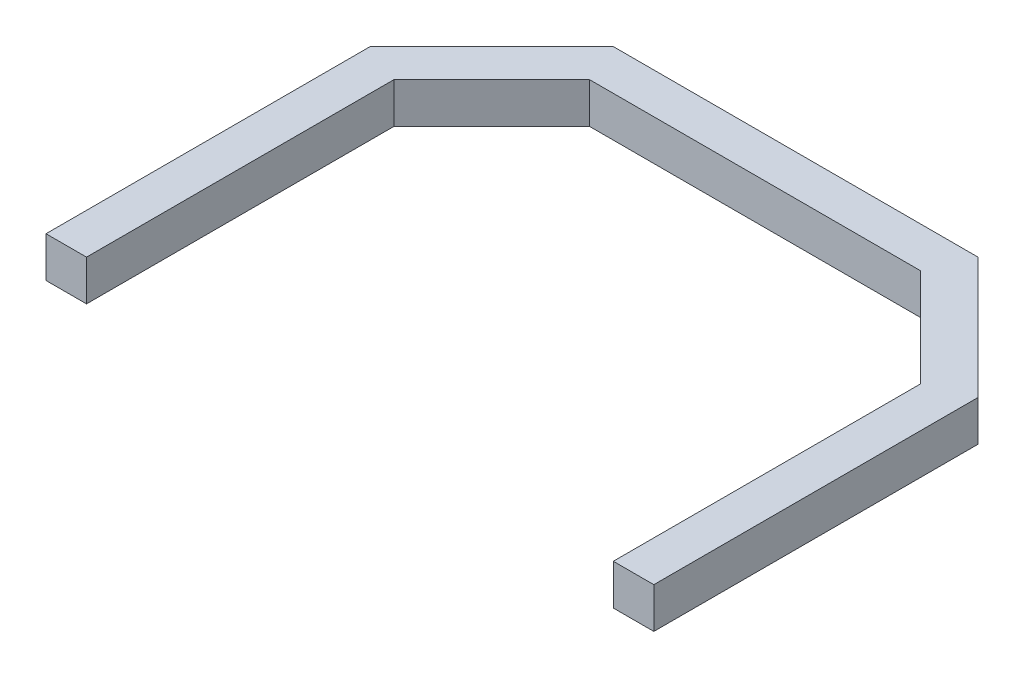
ISO-10303-21;
HEADER;
FILE_DESCRIPTION(('STEP AP214'),'2;1');
FILE_NAME('part.step','',(''),(''),'','','');
FILE_SCHEMA(('AUTOMOTIVE_DESIGN { 1 0 10303 214 1 1 1 1 }'));
ENDSEC;
DATA;
#1=APPLICATION_CONTEXT('core data for automotive mechanical design processes');
#2=APPLICATION_PROTOCOL_DEFINITION('international standard','automotive_design',2000,#1);
#3=PRODUCT_CONTEXT('',#1,'mechanical');
#4=PRODUCT('Part','Part','',(#3));
#5=PRODUCT_RELATED_PRODUCT_CATEGORY('part','',(#4));
#6=PRODUCT_DEFINITION_FORMATION('','',#4);
#7=PRODUCT_DEFINITION_CONTEXT('part definition',#1,'design');
#8=PRODUCT_DEFINITION('design','',#6,#7);
#9=PRODUCT_DEFINITION_SHAPE('','',#8);
#10=(LENGTH_UNIT() NAMED_UNIT(*) SI_UNIT(.MILLI.,.METRE.));
#11=(NAMED_UNIT(*) PLANE_ANGLE_UNIT() SI_UNIT($,.RADIAN.));
#12=(NAMED_UNIT(*) SI_UNIT($,.STERADIAN.) SOLID_ANGLE_UNIT());
#13=UNCERTAINTY_MEASURE_WITH_UNIT(LENGTH_MEASURE(1.E-05),#10,'distance_accuracy_value','');
#14=(GEOMETRIC_REPRESENTATION_CONTEXT(3) GLOBAL_UNCERTAINTY_ASSIGNED_CONTEXT((#13)) GLOBAL_UNIT_ASSIGNED_CONTEXT((#10,
#11,#12)) REPRESENTATION_CONTEXT('',''));
#15=CARTESIAN_POINT('',(0.,0.,0.));
#16=DIRECTION('',(0.,0.,1.));
#17=DIRECTION('',(1.,0.,0.));
#18=AXIS2_PLACEMENT_3D('',#15,#16,#17);
#19=CARTESIAN_POINT('',(35.9847494553377,5.,46.0566448801743));
#20=DIRECTION('',(0.,0.,-1.));
#21=DIRECTION('',(-1.,0.,0.));
#22=AXIS2_PLACEMENT_3D('',#19,#20,#21);
#23=PLANE('',#22);
#24=DIRECTION('',(1.,0.,0.));
#25=VECTOR('',#24,1.);
#26=CARTESIAN_POINT('',(35.9847494553377,0.,46.0566448801743));
#27=LINE('',#26,#25);
#28=CARTESIAN_POINT('',(30.9847494553377,0.,46.0566448801743));
#29=VERTEX_POINT('',#28);
#30=CARTESIAN_POINT('',(35.9847494553377,0.,46.0566448801743));
#31=VERTEX_POINT('',#30);
#32=EDGE_CURVE('E153',#29,#31,#27,.T.);
#33=ORIENTED_EDGE('',*,*,#32,.T.);
#34=DIRECTION('',(0.,-1.,0.));
#35=VECTOR('',#34,1.);
#36=CARTESIAN_POINT('',(35.9847494553377,5.,46.0566448801743));
#37=LINE('',#36,#35);
#38=CARTESIAN_POINT('',(35.9847494553377,5.,46.0566448801743));
#39=VERTEX_POINT('',#38);
#40=EDGE_CURVE('E11',#39,#31,#37,.T.);
#41=ORIENTED_EDGE('',*,*,#40,.F.);
#42=DIRECTION('',(1.,0.,0.));
#43=VECTOR('',#42,1.);
#44=CARTESIAN_POINT('',(35.9847494553377,5.,46.0566448801743));
#45=LINE('',#44,#43);
#46=CARTESIAN_POINT('',(30.9847494553377,5.,46.0566448801743));
#47=VERTEX_POINT('',#46);
#48=EDGE_CURVE('E175',#47,#39,#45,.T.);
#49=ORIENTED_EDGE('',*,*,#48,.F.);
#50=DIRECTION('',(0.,-1.,0.));
#51=VECTOR('',#50,1.);
#52=CARTESIAN_POINT('',(30.9847494553377,5.,46.0566448801743));
#53=LINE('',#52,#51);
#54=EDGE_CURVE('E149',#47,#29,#53,.T.);
#55=ORIENTED_EDGE('',*,*,#54,.T.);
#56=EDGE_LOOP('',(#33,#41,#49,#55));
#57=FACE_BOUND('',#56,.T.);
#58=ADVANCED_FACE('F33',(#57),#23,.F.);
#59=CARTESIAN_POINT('',(35.9847494553377,5.,6.0566448801743));
#60=DIRECTION('',(-1.,0.,0.));
#61=DIRECTION('',(0.,0.,1.));
#62=AXIS2_PLACEMENT_3D('',#59,#60,#61);
#63=PLANE('',#62);
#64=DIRECTION('',(0.,0.,-1.));
#65=VECTOR('',#64,1.);
#66=CARTESIAN_POINT('',(35.9847494553377,0.,6.0566448801743));
#67=LINE('',#66,#65);
#68=CARTESIAN_POINT('',(35.9847494553377,0.,6.0566448801743));
#69=VERTEX_POINT('',#68);
#70=EDGE_CURVE('E156',#31,#69,#67,.T.);
#71=ORIENTED_EDGE('',*,*,#70,.T.);
#72=DIRECTION('',(0.,-1.,0.));
#73=VECTOR('',#72,1.);
#74=CARTESIAN_POINT('',(35.9847494553377,5.,6.0566448801743));
#75=LINE('',#74,#73);
#76=CARTESIAN_POINT('',(35.9847494553377,5.,6.0566448801743));
#77=VERTEX_POINT('',#76);
#78=EDGE_CURVE('E41',#77,#69,#75,.T.);
#79=ORIENTED_EDGE('',*,*,#78,.F.);
#80=DIRECTION('',(0.,0.,-1.));
#81=VECTOR('',#80,1.);
#82=CARTESIAN_POINT('',(35.9847494553377,5.,6.0566448801743));
#83=LINE('',#82,#81);
#84=EDGE_CURVE('E104',#39,#77,#83,.T.);
#85=ORIENTED_EDGE('',*,*,#84,.F.);
#86=ORIENTED_EDGE('',*,*,#40,.T.);
#87=EDGE_LOOP('',(#71,#79,#85,#86));
#88=FACE_BOUND('',#87,.T.);
#89=ADVANCED_FACE('F253',(#88),#63,.F.);
#90=CARTESIAN_POINT('',(20.9847494553377,5.,-8.9433551198257));
#91=DIRECTION('',(-0.707106781186548,0.,0.707106781186548));
#92=DIRECTION('',(0.707106781186548,0.,0.707106781186548));
#93=AXIS2_PLACEMENT_3D('',#90,#91,#92);
#94=PLANE('',#93);
#95=DIRECTION('',(-0.707106781186547,0.,-0.707106781186547));
#96=VECTOR('',#95,1.);
#97=CARTESIAN_POINT('',(20.9847494553377,0.,-8.9433551198257));
#98=LINE('',#97,#96);
#99=CARTESIAN_POINT('',(20.9847494553377,0.,-8.9433551198257));
#100=VERTEX_POINT('',#99);
#101=EDGE_CURVE('E158',#69,#100,#98,.T.);
#102=ORIENTED_EDGE('',*,*,#101,.T.);
#103=DIRECTION('',(0.,-1.,0.));
#104=VECTOR('',#103,1.);
#105=CARTESIAN_POINT('',(20.9847494553377,5.,-8.9433551198257));
#106=LINE('',#105,#104);
#107=CARTESIAN_POINT('',(20.9847494553377,5.,-8.9433551198257));
#108=VERTEX_POINT('',#107);
#109=EDGE_CURVE('E194',#108,#100,#106,.T.);
#110=ORIENTED_EDGE('',*,*,#109,.F.);
#111=DIRECTION('',(-0.707106781186547,0.,-0.707106781186547));
#112=VECTOR('',#111,1.);
#113=CARTESIAN_POINT('',(20.9847494553377,5.,-8.9433551198257));
#114=LINE('',#113,#112);
#115=EDGE_CURVE('E202',#77,#108,#114,.T.);
#116=ORIENTED_EDGE('',*,*,#115,.F.);
#117=ORIENTED_EDGE('',*,*,#78,.T.);
#118=EDGE_LOOP('',(#102,#110,#116,#117));
#119=FACE_BOUND('',#118,.T.);
#120=ADVANCED_FACE('F200',(#119),#94,.F.);
#121=CARTESIAN_POINT('',(-24.0152505446623,5.,-8.9433551198257));
#122=DIRECTION('',(0.,0.,1.));
#123=DIRECTION('',(1.,0.,0.));
#124=AXIS2_PLACEMENT_3D('',#121,#122,#123);
#125=PLANE('',#124);
#126=DIRECTION('',(-1.,0.,0.));
#127=VECTOR('',#126,1.);
#128=CARTESIAN_POINT('',(-24.0152505446623,0.,-8.9433551198257));
#129=LINE('',#128,#127);
#130=CARTESIAN_POINT('',(-24.0152505446623,0.,-8.9433551198257));
#131=VERTEX_POINT('',#130);
#132=EDGE_CURVE('E160',#100,#131,#129,.T.);
#133=ORIENTED_EDGE('',*,*,#132,.T.);
#134=DIRECTION('',(0.,-1.,0.));
#135=VECTOR('',#134,1.);
#136=CARTESIAN_POINT('',(-24.0152505446623,5.,-8.9433551198257));
#137=LINE('',#136,#135);
#138=CARTESIAN_POINT('',(-24.0152505446623,5.,-8.9433551198257));
#139=VERTEX_POINT('',#138);
#140=EDGE_CURVE('E191',#139,#131,#137,.T.);
#141=ORIENTED_EDGE('',*,*,#140,.F.);
#142=DIRECTION('',(-1.,0.,0.));
#143=VECTOR('',#142,1.);
#144=CARTESIAN_POINT('',(-24.0152505446623,5.,-8.9433551198257));
#145=LINE('',#144,#143);
#146=EDGE_CURVE('E220',#108,#139,#145,.T.);
#147=ORIENTED_EDGE('',*,*,#146,.F.);
#148=ORIENTED_EDGE('',*,*,#109,.T.);
#149=EDGE_LOOP('',(#133,#141,#147,#148));
#150=FACE_BOUND('',#149,.T.);
#151=ADVANCED_FACE('F211',(#150),#125,.F.);
#152=CARTESIAN_POINT('',(-39.0152505446623,5.,6.0566448801743));
#153=DIRECTION('',(0.707106781186548,0.,0.707106781186548));
#154=DIRECTION('',(0.707106781186548,0.,-0.707106781186548));
#155=AXIS2_PLACEMENT_3D('',#152,#153,#154);
#156=PLANE('',#155);
#157=DIRECTION('',(-0.707106781186547,0.,0.707106781186547));
#158=VECTOR('',#157,1.);
#159=CARTESIAN_POINT('',(-39.0152505446623,0.,6.0566448801743));
#160=LINE('',#159,#158);
#161=CARTESIAN_POINT('',(-39.0152505446623,0.,6.0566448801743));
#162=VERTEX_POINT('',#161);
#163=EDGE_CURVE('E162',#131,#162,#160,.T.);
#164=ORIENTED_EDGE('',*,*,#163,.T.);
#165=DIRECTION('',(0.,-1.,0.));
#166=VECTOR('',#165,1.);
#167=CARTESIAN_POINT('',(-39.0152505446623,5.,6.0566448801743));
#168=LINE('',#167,#166);
#169=CARTESIAN_POINT('',(-39.0152505446623,5.,6.0566448801743));
#170=VERTEX_POINT('',#169);
#171=EDGE_CURVE('E188',#170,#162,#168,.T.);
#172=ORIENTED_EDGE('',*,*,#171,.F.);
#173=DIRECTION('',(-0.707106781186547,0.,0.707106781186547));
#174=VECTOR('',#173,1.);
#175=CARTESIAN_POINT('',(-39.0152505446623,5.,6.0566448801743));
#176=LINE('',#175,#174);
#177=EDGE_CURVE('E217',#139,#170,#176,.T.);
#178=ORIENTED_EDGE('',*,*,#177,.F.);
#179=ORIENTED_EDGE('',*,*,#140,.T.);
#180=EDGE_LOOP('',(#164,#172,#178,#179));
#181=FACE_BOUND('',#180,.T.);
#182=ADVANCED_FACE('F215',(#181),#156,.F.);
#183=CARTESIAN_POINT('',(-39.0152505446623,5.,6.0566448801743));
#184=DIRECTION('',(1.,0.,0.));
#185=DIRECTION('',(0.,0.,-1.));
#186=AXIS2_PLACEMENT_3D('',#183,#184,#185);
#187=PLANE('',#186);
#188=DIRECTION('',(0.,0.,1.));
#189=VECTOR('',#188,1.);
#190=CARTESIAN_POINT('',(-39.0152505446623,0.,6.0566448801743));
#191=LINE('',#190,#189);
#192=CARTESIAN_POINT('',(-39.0152505446623,0.,46.0566448801743));
#193=VERTEX_POINT('',#192);
#194=EDGE_CURVE('E164',#162,#193,#191,.T.);
#195=ORIENTED_EDGE('',*,*,#194,.T.);
#196=DIRECTION('',(0.,-1.,0.));
#197=VECTOR('',#196,1.);
#198=CARTESIAN_POINT('',(-39.0152505446623,5.,46.0566448801743));
#199=LINE('',#198,#197);
#200=CARTESIAN_POINT('',(-39.0152505446623,5.,46.0566448801743));
#201=VERTEX_POINT('',#200);
#202=EDGE_CURVE('E185',#201,#193,#199,.T.);
#203=ORIENTED_EDGE('',*,*,#202,.F.);
#204=DIRECTION('',(0.,0.,1.));
#205=VECTOR('',#204,1.);
#206=CARTESIAN_POINT('',(-39.0152505446623,5.,6.0566448801743));
#207=LINE('',#206,#205);
#208=EDGE_CURVE('E219',#170,#201,#207,.T.);
#209=ORIENTED_EDGE('',*,*,#208,.F.);
#210=ORIENTED_EDGE('',*,*,#171,.T.);
#211=EDGE_LOOP('',(#195,#203,#209,#210));
#212=FACE_BOUND('',#211,.T.);
#213=ADVANCED_FACE('F266',(#212),#187,.F.);
#214=CARTESIAN_POINT('',(-34.0152505446623,5.,46.0566448801743));
#215=DIRECTION('',(0.,0.,-1.));
#216=DIRECTION('',(-1.,0.,0.));
#217=AXIS2_PLACEMENT_3D('',#214,#215,#216);
#218=PLANE('',#217);
#219=DIRECTION('',(1.,0.,0.));
#220=VECTOR('',#219,1.);
#221=CARTESIAN_POINT('',(-34.0152505446623,0.,46.0566448801743));
#222=LINE('',#221,#220);
#223=CARTESIAN_POINT('',(-34.0152505446623,0.,46.0566448801743));
#224=VERTEX_POINT('',#223);
#225=EDGE_CURVE('E166',#193,#224,#222,.T.);
#226=ORIENTED_EDGE('',*,*,#225,.T.);
#227=DIRECTION('',(0.,-1.,0.));
#228=VECTOR('',#227,1.);
#229=CARTESIAN_POINT('',(-34.0152505446623,5.,46.0566448801743));
#230=LINE('',#229,#228);
#231=CARTESIAN_POINT('',(-34.0152505446623,5.,46.0566448801743));
#232=VERTEX_POINT('',#231);
#233=EDGE_CURVE('E182',#232,#224,#230,.T.);
#234=ORIENTED_EDGE('',*,*,#233,.F.);
#235=DIRECTION('',(1.,0.,0.));
#236=VECTOR('',#235,1.);
#237=CARTESIAN_POINT('',(-34.0152505446623,5.,46.0566448801743));
#238=LINE('',#237,#236);
#239=EDGE_CURVE('E222',#201,#232,#238,.T.);
#240=ORIENTED_EDGE('',*,*,#239,.F.);
#241=ORIENTED_EDGE('',*,*,#202,.T.);
#242=EDGE_LOOP('',(#226,#234,#240,#241));
#243=FACE_BOUND('',#242,.T.);
#244=ADVANCED_FACE('F269',(#243),#218,.F.);
#245=CARTESIAN_POINT('',(-34.0152505446623,5.,8.12771269203978));
#246=DIRECTION('',(-1.,0.,0.));
#247=DIRECTION('',(0.,0.,1.));
#248=AXIS2_PLACEMENT_3D('',#245,#246,#247);
#249=PLANE('',#248);
#250=DIRECTION('',(0.,0.,-1.));
#251=VECTOR('',#250,1.);
#252=CARTESIAN_POINT('',(-34.0152505446623,0.,8.12771269203978));
#253=LINE('',#252,#251);
#254=CARTESIAN_POINT('',(-34.0152505446623,0.,8.12771269203978));
#255=VERTEX_POINT('',#254);
#256=EDGE_CURVE('E168',#224,#255,#253,.T.);
#257=ORIENTED_EDGE('',*,*,#256,.T.);
#258=DIRECTION('',(0.,-1.,0.));
#259=VECTOR('',#258,1.);
#260=CARTESIAN_POINT('',(-34.0152505446623,5.,8.12771269203978));
#261=LINE('',#260,#259);
#262=CARTESIAN_POINT('',(-34.0152505446623,5.,8.12771269203978));
#263=VERTEX_POINT('',#262);
#264=EDGE_CURVE('E179',#263,#255,#261,.T.);
#265=ORIENTED_EDGE('',*,*,#264,.F.);
#266=DIRECTION('',(0.,0.,-1.));
#267=VECTOR('',#266,1.);
#268=CARTESIAN_POINT('',(-34.0152505446623,5.,8.12771269203978));
#269=LINE('',#268,#267);
#270=EDGE_CURVE('E228',#232,#263,#269,.T.);
#271=ORIENTED_EDGE('',*,*,#270,.F.);
#272=ORIENTED_EDGE('',*,*,#233,.T.);
#273=EDGE_LOOP('',(#257,#265,#271,#272));
#274=FACE_BOUND('',#273,.T.);
#275=ADVANCED_FACE('F234',(#274),#249,.F.);
#276=CARTESIAN_POINT('',(-34.0152505446623,5.,8.12771269203978));
#277=DIRECTION('',(-0.707106781186548,0.,-0.707106781186548));
#278=DIRECTION('',(-0.707106781186548,0.,0.707106781186548));
#279=AXIS2_PLACEMENT_3D('',#276,#277,#278);
#280=PLANE('',#279);
#281=DIRECTION('',(0.707106781186547,0.,-0.707106781186547));
#282=VECTOR('',#281,1.);
#283=CARTESIAN_POINT('',(-34.0152505446623,0.,8.12771269203978));
#284=LINE('',#283,#282);
#285=CARTESIAN_POINT('',(-21.9441827327968,0.,-3.9433551198257));
#286=VERTEX_POINT('',#285);
#287=EDGE_CURVE('E170',#255,#286,#284,.T.);
#288=ORIENTED_EDGE('',*,*,#287,.T.);
#289=DIRECTION('',(0.,-1.,0.));
#290=VECTOR('',#289,1.);
#291=CARTESIAN_POINT('',(-21.9441827327968,5.,-3.9433551198257));
#292=LINE('',#291,#290);
#293=CARTESIAN_POINT('',(-21.9441827327968,5.,-3.9433551198257));
#294=VERTEX_POINT('',#293);
#295=EDGE_CURVE('E144',#294,#286,#292,.T.);
#296=ORIENTED_EDGE('',*,*,#295,.F.);
#297=DIRECTION('',(0.707106781186547,0.,-0.707106781186547));
#298=VECTOR('',#297,1.);
#299=CARTESIAN_POINT('',(-34.0152505446623,5.,8.12771269203978));
#300=LINE('',#299,#298);
#301=EDGE_CURVE('E135',#263,#294,#300,.T.);
#302=ORIENTED_EDGE('',*,*,#301,.F.);
#303=ORIENTED_EDGE('',*,*,#264,.T.);
#304=EDGE_LOOP('',(#288,#296,#302,#303));
#305=FACE_BOUND('',#304,.T.);
#306=ADVANCED_FACE('F238',(#305),#280,.F.);
#307=CARTESIAN_POINT('',(-21.9441827327968,5.,-3.9433551198257));
#308=DIRECTION('',(0.,0.,-1.));
#309=DIRECTION('',(-1.,0.,0.));
#310=AXIS2_PLACEMENT_3D('',#307,#308,#309);
#311=PLANE('',#310);
#312=DIRECTION('',(1.,0.,0.));
#313=VECTOR('',#312,1.);
#314=CARTESIAN_POINT('',(-21.9441827327968,0.,-3.9433551198257));
#315=LINE('',#314,#313);
#316=CARTESIAN_POINT('',(18.9136816434722,0.,-3.9433551198257));
#317=VERTEX_POINT('',#316);
#318=EDGE_CURVE('E143',#286,#317,#315,.T.);
#319=ORIENTED_EDGE('',*,*,#318,.T.);
#320=DIRECTION('',(0.,-1.,0.));
#321=VECTOR('',#320,1.);
#322=CARTESIAN_POINT('',(18.9136816434722,5.,-3.9433551198257));
#323=LINE('',#322,#321);
#324=CARTESIAN_POINT('',(18.9136816434722,5.,-3.9433551198257));
#325=VERTEX_POINT('',#324);
#326=EDGE_CURVE('E140',#325,#317,#323,.T.);
#327=ORIENTED_EDGE('',*,*,#326,.F.);
#328=DIRECTION('',(1.,0.,0.));
#329=VECTOR('',#328,1.);
#330=CARTESIAN_POINT('',(-21.9441827327968,5.,-3.9433551198257));
#331=LINE('',#330,#329);
#332=EDGE_CURVE('E129',#294,#325,#331,.T.);
#333=ORIENTED_EDGE('',*,*,#332,.F.);
#334=ORIENTED_EDGE('',*,*,#295,.T.);
#335=EDGE_LOOP('',(#319,#327,#333,#334));
#336=FACE_BOUND('',#335,.T.);
#337=ADVANCED_FACE('F141',(#336),#311,.F.);
#338=CARTESIAN_POINT('',(18.9136816434722,5.,-3.9433551198257));
#339=DIRECTION('',(0.707106781186548,0.,-0.707106781186548));
#340=DIRECTION('',(-0.707106781186548,0.,-0.707106781186548));
#341=AXIS2_PLACEMENT_3D('',#338,#339,#340);
#342=PLANE('',#341);
#343=DIRECTION('',(0.707106781186547,0.,0.707106781186547));
#344=VECTOR('',#343,1.);
#345=CARTESIAN_POINT('',(18.9136816434722,0.,-3.9433551198257));
#346=LINE('',#345,#344);
#347=CARTESIAN_POINT('',(30.9847494553377,0.,8.12771269203978));
#348=VERTEX_POINT('',#347);
#349=EDGE_CURVE('E90',#317,#348,#346,.T.);
#350=ORIENTED_EDGE('',*,*,#349,.T.);
#351=DIRECTION('',(0.,-1.,0.));
#352=VECTOR('',#351,1.);
#353=CARTESIAN_POINT('',(30.9847494553377,5.,8.12771269203978));
#354=LINE('',#353,#352);
#355=CARTESIAN_POINT('',(30.9847494553377,5.,8.12771269203978));
#356=VERTEX_POINT('',#355);
#357=EDGE_CURVE('E145',#356,#348,#354,.T.);
#358=ORIENTED_EDGE('',*,*,#357,.F.);
#359=DIRECTION('',(0.707106781186547,0.,0.707106781186547));
#360=VECTOR('',#359,1.);
#361=CARTESIAN_POINT('',(18.9136816434722,5.,-3.9433551198257));
#362=LINE('',#361,#360);
#363=EDGE_CURVE('E133',#325,#356,#362,.T.);
#364=ORIENTED_EDGE('',*,*,#363,.F.);
#365=ORIENTED_EDGE('',*,*,#326,.T.);
#366=EDGE_LOOP('',(#350,#358,#364,#365));
#367=FACE_BOUND('',#366,.T.);
#368=ADVANCED_FACE('F147',(#367),#342,.F.);
#369=CARTESIAN_POINT('',(30.9847494553377,5.,8.12771269203978));
#370=DIRECTION('',(1.,0.,0.));
#371=DIRECTION('',(0.,0.,-1.));
#372=AXIS2_PLACEMENT_3D('',#369,#370,#371);
#373=PLANE('',#372);
#374=DIRECTION('',(0.,0.,1.));
#375=VECTOR('',#374,1.);
#376=CARTESIAN_POINT('',(30.9847494553377,0.,8.12771269203978));
#377=LINE('',#376,#375);
#378=EDGE_CURVE('E96',#348,#29,#377,.T.);
#379=ORIENTED_EDGE('',*,*,#378,.T.);
#380=ORIENTED_EDGE('',*,*,#54,.F.);
#381=DIRECTION('',(0.,0.,1.));
#382=VECTOR('',#381,1.);
#383=CARTESIAN_POINT('',(30.9847494553377,5.,8.12771269203978));
#384=LINE('',#383,#382);
#385=EDGE_CURVE('E49',#356,#47,#384,.T.);
#386=ORIENTED_EDGE('',*,*,#385,.F.);
#387=ORIENTED_EDGE('',*,*,#357,.T.);
#388=EDGE_LOOP('',(#379,#380,#386,#387));
#389=FACE_BOUND('',#388,.T.);
#390=ADVANCED_FACE('F242',(#389),#373,.F.);
#391=CARTESIAN_POINT('',(0.,5.,0.));
#392=DIRECTION('',(0.,1.,0.));
#393=DIRECTION('',(0.,0.,1.));
#394=AXIS2_PLACEMENT_3D('',#391,#392,#393);
#395=PLANE('',#394);
#396=ORIENTED_EDGE('',*,*,#48,.T.);
#397=ORIENTED_EDGE('',*,*,#84,.T.);
#398=ORIENTED_EDGE('',*,*,#115,.T.);
#399=ORIENTED_EDGE('',*,*,#146,.T.);
#400=ORIENTED_EDGE('',*,*,#177,.T.);
#401=ORIENTED_EDGE('',*,*,#208,.T.);
#402=ORIENTED_EDGE('',*,*,#239,.T.);
#403=ORIENTED_EDGE('',*,*,#270,.T.);
#404=ORIENTED_EDGE('',*,*,#301,.T.);
#405=ORIENTED_EDGE('',*,*,#332,.T.);
#406=ORIENTED_EDGE('',*,*,#363,.T.);
#407=ORIENTED_EDGE('',*,*,#385,.T.);
#408=EDGE_LOOP('',(#396,#397,#398,#399,#400,#401,#402,#403,#404,#405,#406,#407));
#409=FACE_BOUND('',#408,.T.);
#410=ADVANCED_FACE('F131',(#409),#395,.T.);
#411=CARTESIAN_POINT('',(0.,0.,0.));
#412=DIRECTION('',(0.,1.,0.));
#413=DIRECTION('',(0.,0.,1.));
#414=AXIS2_PLACEMENT_3D('',#411,#412,#413);
#415=PLANE('',#414);
#416=ORIENTED_EDGE('',*,*,#32,.F.);
#417=ORIENTED_EDGE('',*,*,#378,.F.);
#418=ORIENTED_EDGE('',*,*,#349,.F.);
#419=ORIENTED_EDGE('',*,*,#318,.F.);
#420=ORIENTED_EDGE('',*,*,#287,.F.);
#421=ORIENTED_EDGE('',*,*,#256,.F.);
#422=ORIENTED_EDGE('',*,*,#225,.F.);
#423=ORIENTED_EDGE('',*,*,#194,.F.);
#424=ORIENTED_EDGE('',*,*,#163,.F.);
#425=ORIENTED_EDGE('',*,*,#132,.F.);
#426=ORIENTED_EDGE('',*,*,#101,.F.);
#427=ORIENTED_EDGE('',*,*,#70,.F.);
#428=EDGE_LOOP('',(#416,#417,#418,#419,#420,#421,#422,#423,#424,#425,#426,#427));
#429=FACE_BOUND('',#428,.T.);
#430=ADVANCED_FACE('F206',(#429),#415,.F.);
#431=CLOSED_SHELL('',(#58,#89,#120,#151,#182,#213,#244,#275,#306,#337,#368,#390,#410,#430));
#432=MANIFOLD_SOLID_BREP('B2',#431);
#433=ADVANCED_BREP_SHAPE_REPRESENTATION('',(#18,#432),#14);
#434=SHAPE_DEFINITION_REPRESENTATION(#9,#433);
ENDSEC;
END-ISO-10303-21;
